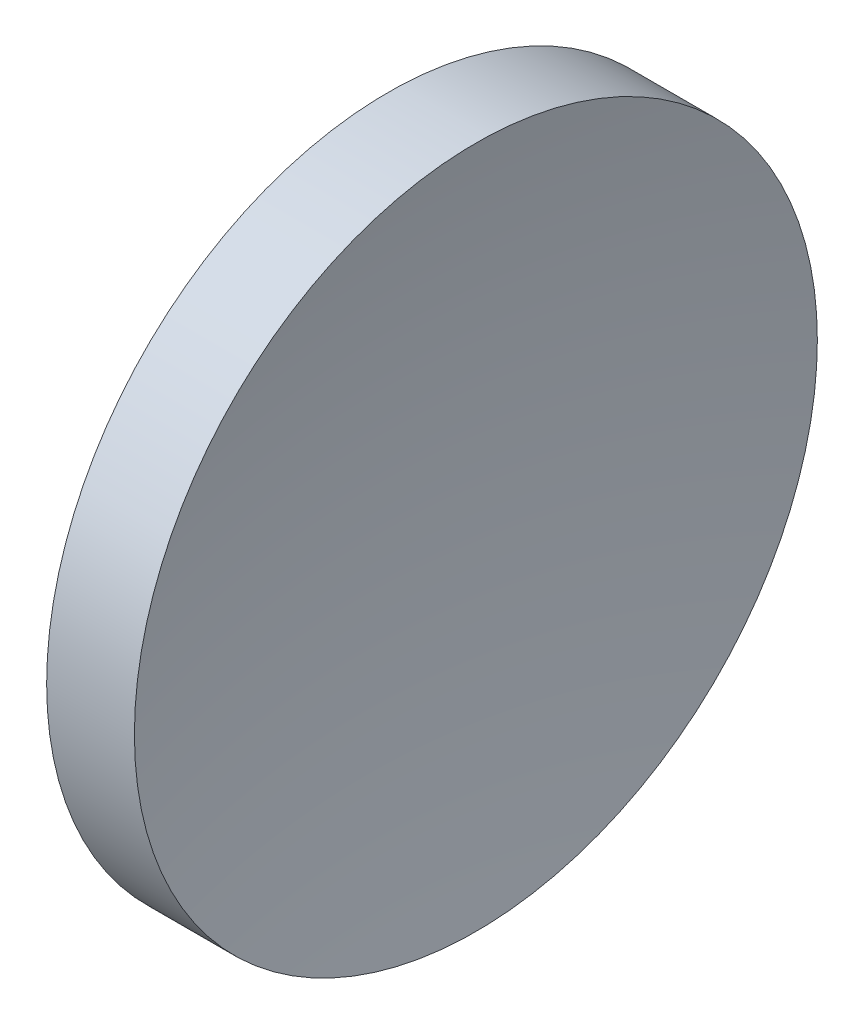
ISO-10303-21;
HEADER;
FILE_DESCRIPTION(('STEP AP214'),'2;1');
FILE_NAME('part.step','',(''),(''),'','','');
FILE_SCHEMA(('AUTOMOTIVE_DESIGN { 1 0 10303 214 1 1 1 1 }'));
ENDSEC;
DATA;
#1=APPLICATION_CONTEXT('core data for automotive mechanical design processes');
#2=APPLICATION_PROTOCOL_DEFINITION('international standard','automotive_design',2000,#1);
#3=PRODUCT_CONTEXT('',#1,'mechanical');
#4=PRODUCT('Part','Part','',(#3));
#5=PRODUCT_RELATED_PRODUCT_CATEGORY('part','',(#4));
#6=PRODUCT_DEFINITION_FORMATION('','',#4);
#7=PRODUCT_DEFINITION_CONTEXT('part definition',#1,'design');
#8=PRODUCT_DEFINITION('design','',#6,#7);
#9=PRODUCT_DEFINITION_SHAPE('','',#8);
#10=(LENGTH_UNIT() NAMED_UNIT(*) SI_UNIT(.MILLI.,.METRE.));
#11=(NAMED_UNIT(*) PLANE_ANGLE_UNIT() SI_UNIT($,.RADIAN.));
#12=(NAMED_UNIT(*) SI_UNIT($,.STERADIAN.) SOLID_ANGLE_UNIT());
#13=UNCERTAINTY_MEASURE_WITH_UNIT(LENGTH_MEASURE(1.E-05),#10,'distance_accuracy_value','');
#14=(GEOMETRIC_REPRESENTATION_CONTEXT(3) GLOBAL_UNCERTAINTY_ASSIGNED_CONTEXT((#13)) GLOBAL_UNIT_ASSIGNED_CONTEXT((#10,
#11,#12)) REPRESENTATION_CONTEXT('',''));
#15=CARTESIAN_POINT('',(0.,0.,0.));
#16=DIRECTION('',(0.,0.,1.));
#17=DIRECTION('',(1.,0.,0.));
#18=AXIS2_PLACEMENT_3D('',#15,#16,#17);
#19=CARTESIAN_POINT('',(124.082319943728,32.6107681292268,0.0469972926640597));
#20=DIRECTION('',(0.,-1.,0.));
#21=DIRECTION('',(0.,0.,1.));
#22=AXIS2_PLACEMENT_3D('',#19,#20,#21);
#23=CIRCLE('',#22,64.55);
#24=TRIMMED_CURVE('',#23,(PARAMETER_VALUE(-1.57152440265572)),
(PARAMETER_VALUE(1.57152440265572)),.T.,.PARAMETER.);
#25=CARTESIAN_POINT('',(124.082319943728,32.6107681292268,0.));
#26=DIRECTION('',(-1.,0.,0.));
#27=AXIS1_PLACEMENT('',#25,#26);
#28=SURFACE_OF_REVOLUTION('',#24,#27);
#29=CARTESIAN_POINT('',(60.7449279578635,32.6107681292268,0.));
#30=DIRECTION('',(-1.,0.,0.));
#31=DIRECTION('',(0.,0.,1.));
#32=AXIS2_PLACEMENT_3D('',#29,#30,#31);
#33=CIRCLE('',#32,12.5);
#34=CARTESIAN_POINT('',(60.7449279578635,32.6107681292268,12.5));
#35=VERTEX_POINT('',#34);
#36=EDGE_CURVE('E11',#35,#35,#33,.T.);
#37=ORIENTED_EDGE('',*,*,#36,.F.);
#38=EDGE_LOOP('',(#37));
#39=FACE_BOUND('',#38,.T.);
#40=CARTESIAN_POINT('',(59.5323370525261,32.6107681292268,0.));
#41=VERTEX_POINT('',#40);
#42=VERTEX_LOOP('',#41);
#43=FACE_BOUND('',#42,.T.);
#44=ADVANCED_FACE('F37',(#39,#43),#28,.F.);
#45=CARTESIAN_POINT('',(56.1009150799972,32.6107681292268,0.));
#46=DIRECTION('',(-1.,0.,0.));
#47=DIRECTION('',(0.,0.,1.));
#48=AXIS2_PLACEMENT_3D('',#45,#46,#47);
#49=CYLINDRICAL_SURFACE('',#48,12.5);
#50=CARTESIAN_POINT('',(57.5323370525261,32.6107681292268,0.));
#51=DIRECTION('',(-1.,0.,0.));
#52=DIRECTION('',(0.,0.,1.));
#53=AXIS2_PLACEMENT_3D('',#50,#51,#52);
#54=CIRCLE('',#53,12.5);
#55=CARTESIAN_POINT('',(57.5323370525261,32.6107681292268,12.5));
#56=VERTEX_POINT('',#55);
#57=EDGE_CURVE('E43',#56,#56,#54,.T.);
#58=ORIENTED_EDGE('',*,*,#57,.F.);
#59=EDGE_LOOP('',(#58));
#60=FACE_BOUND('',#59,.T.);
#61=ORIENTED_EDGE('',*,*,#36,.T.);
#62=EDGE_LOOP('',(#61));
#63=FACE_BOUND('',#62,.T.);
#64=ADVANCED_FACE('F47',(#60,#63),#49,.T.);
#65=CARTESIAN_POINT('',(57.5323370525261,32.6107681292268,0.));
#66=DIRECTION('',(1.,0.,0.));
#67=DIRECTION('',(0.,0.,-1.));
#68=AXIS2_PLACEMENT_3D('',#65,#66,#67);
#69=PLANE('',#68);
#70=ORIENTED_EDGE('',*,*,#57,.T.);
#71=EDGE_LOOP('',(#70));
#72=FACE_BOUND('',#71,.T.);
#73=ADVANCED_FACE('F52',(#72),#69,.F.);
#74=CLOSED_SHELL('',(#44,#64,#73));
#75=MANIFOLD_SOLID_BREP('B2',#74);
#76=ADVANCED_BREP_SHAPE_REPRESENTATION('',(#18,#75),#14);
#77=SHAPE_DEFINITION_REPRESENTATION(#9,#76);
ENDSEC;
END-ISO-10303-21;
